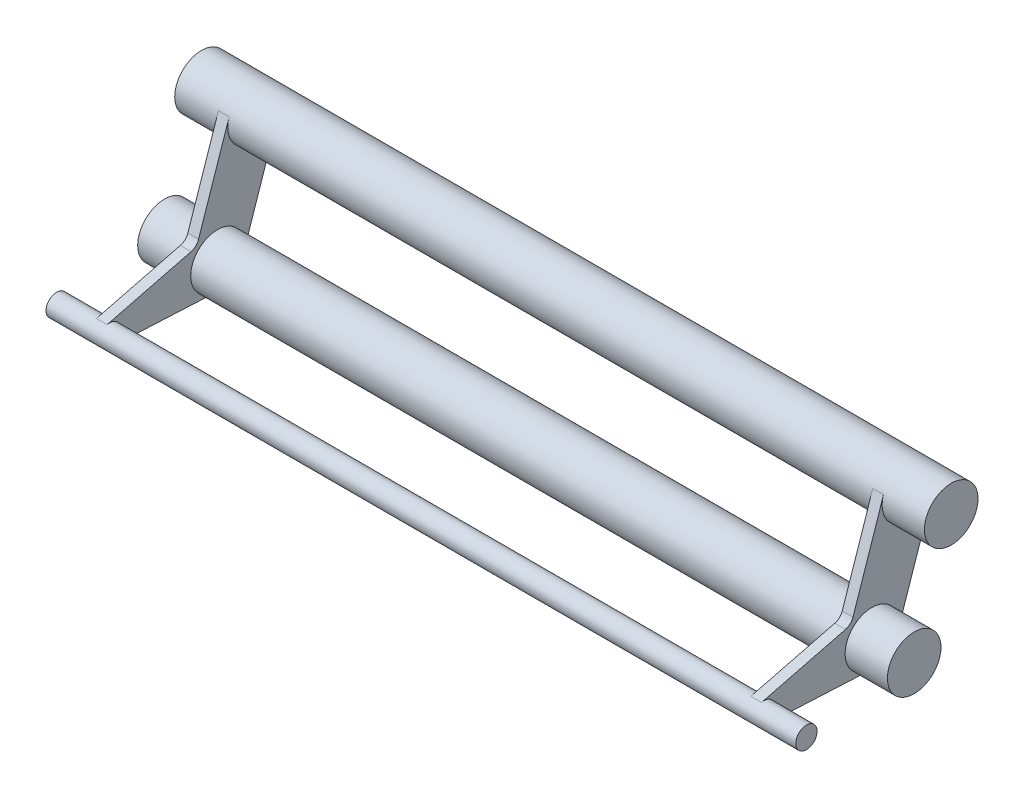
ISO-10303-21;
HEADER;
FILE_DESCRIPTION(('STEP AP214'),'2;1');
FILE_NAME('part.step','',(''),(''),'','','');
FILE_SCHEMA(('AUTOMOTIVE_DESIGN { 1 0 10303 214 1 1 1 1 }'));
ENDSEC;
DATA;
#1=APPLICATION_CONTEXT('core data for automotive mechanical design processes');
#2=APPLICATION_PROTOCOL_DEFINITION('international standard','automotive_design',2000,#1);
#3=PRODUCT_CONTEXT('',#1,'mechanical');
#4=PRODUCT('Part','Part','',(#3));
#5=PRODUCT_RELATED_PRODUCT_CATEGORY('part','',(#4));
#6=PRODUCT_DEFINITION_FORMATION('','',#4);
#7=PRODUCT_DEFINITION_CONTEXT('part definition',#1,'design');
#8=PRODUCT_DEFINITION('design','',#6,#7);
#9=PRODUCT_DEFINITION_SHAPE('','',#8);
#10=(LENGTH_UNIT() NAMED_UNIT(*) SI_UNIT(.MILLI.,.METRE.));
#11=(NAMED_UNIT(*) PLANE_ANGLE_UNIT() SI_UNIT($,.RADIAN.));
#12=(NAMED_UNIT(*) SI_UNIT($,.STERADIAN.) SOLID_ANGLE_UNIT());
#13=UNCERTAINTY_MEASURE_WITH_UNIT(LENGTH_MEASURE(1.E-05),#10,'distance_accuracy_value','');
#14=(GEOMETRIC_REPRESENTATION_CONTEXT(3) GLOBAL_UNCERTAINTY_ASSIGNED_CONTEXT((#13)) GLOBAL_UNIT_ASSIGNED_CONTEXT((#10,
#11,#12)) REPRESENTATION_CONTEXT('',''));
#15=CARTESIAN_POINT('',(0.,0.,0.));
#16=DIRECTION('',(0.,0.,1.));
#17=DIRECTION('',(1.,0.,0.));
#18=AXIS2_PLACEMENT_3D('',#15,#16,#17);
#19=CARTESIAN_POINT('',(122.2,0.,0.));
#20=DIRECTION('',(1.,0.,0.));
#21=DIRECTION('',(0.,0.,-1.));
#22=AXIS2_PLACEMENT_3D('',#19,#20,#21);
#23=PLANE('',#22);
#24=DIRECTION('',(0.,-0.245457617101326,0.96940732316552));
#25=VECTOR('',#24,1.);
#26=CARTESIAN_POINT('',(122.2,-20.6404404910664,27.5268420690193));
#27=LINE('',#26,#25);
#28=CARTESIAN_POINT('',(122.2,-16.6693565555392,11.8434915441268));
#29=VERTEX_POINT('',#28);
#30=CARTESIAN_POINT('',(122.2,-20.6404404910664,27.5268420690193));
#31=VERTEX_POINT('',#30);
#32=EDGE_CURVE('E226',#29,#31,#27,.T.);
#33=ORIENTED_EDGE('',*,*,#32,.T.);
#34=CARTESIAN_POINT('',(122.2,-22.5792551373974,27.0359268348167));
#35=DIRECTION('',(1.,0.,0.));
#36=DIRECTION('',(0.,0.,-1.));
#37=AXIS2_PLACEMENT_3D('',#34,#35,#36);
#38=CIRCLE('',#37,2.);
#39=CARTESIAN_POINT('',(122.2,-24.5767712486235,27.1355731362642));
#40=VERTEX_POINT('',#39);
#41=EDGE_CURVE('E200',#40,#31,#38,.T.);
#42=ORIENTED_EDGE('',*,*,#41,.F.);
#43=DIRECTION('',(0.,-0.0498231507237695,-0.998758055613048));
#44=VECTOR('',#43,1.);
#45=CARTESIAN_POINT('',(122.2,-25.5730454154626,7.16419767575851));
#46=LINE('',#45,#44);
#47=CARTESIAN_POINT('',(122.2,-25.5730454154626,7.16419767575851));
#48=VERTEX_POINT('',#47);
#49=EDGE_CURVE('E228',#40,#48,#46,.T.);
#50=ORIENTED_EDGE('',*,*,#49,.T.);
#51=CARTESIAN_POINT('',(122.2,-20.5792551373974,6.91508192213966));
#52=DIRECTION('',(1.,0.,0.));
#53=DIRECTION('',(0.,0.,-1.));
#54=AXIS2_PLACEMENT_3D('',#51,#52,#53);
#55=CIRCLE('',#54,5.);
#56=CARTESIAN_POINT('',(122.2,-22.1718580674157,2.17550220371557));
#57=VERTEX_POINT('',#56);
#58=EDGE_CURVE('E203',#57,#48,#55,.T.);
#59=ORIENTED_EDGE('',*,*,#58,.F.);
#60=DIRECTION('',(0.,0.947915943684818,-0.318520586003669));
#61=VECTOR('',#60,1.);
#62=CARTESIAN_POINT('',(122.2,-1.59260293001835,-4.73957971842409));
#63=LINE('',#62,#61);
#64=CARTESIAN_POINT('',(122.2,-1.59260293001835,-4.73957971842409));
#65=VERTEX_POINT('',#64);
#66=EDGE_CURVE('E231',#57,#65,#63,.T.);
#67=ORIENTED_EDGE('',*,*,#66,.T.);
#68=CARTESIAN_POINT('',(122.2,0.,0.));
#69=DIRECTION('',(1.,0.,0.));
#70=DIRECTION('',(0.,0.,-1.));
#71=AXIS2_PLACEMENT_3D('',#68,#69,#70);
#72=CIRCLE('',#71,5.);
#73=CARTESIAN_POINT('',(122.2,1.59260293001835,4.73957971842409));
#74=VERTEX_POINT('',#73);
#75=EDGE_CURVE('E207',#74,#65,#72,.T.);
#76=ORIENTED_EDGE('',*,*,#75,.F.);
#77=DIRECTION('',(0.,-0.947915943684818,0.318520586003669));
#78=VECTOR('',#77,1.);
#79=CARTESIAN_POINT('',(122.2,-15.3675830812155,10.4385748909598));
#80=LINE('',#79,#78);
#81=CARTESIAN_POINT('',(122.2,-15.3675830812155,10.4385748909598));
#82=VERTEX_POINT('',#81);
#83=EDGE_CURVE('E221',#74,#82,#80,.T.);
#84=ORIENTED_EDGE('',*,*,#83,.T.);
#85=CARTESIAN_POINT('',(122.2,-14.7305419092082,12.3344067783295));
#86=DIRECTION('',(-1.,0.,0.));
#87=DIRECTION('',(0.,0.,-1.));
#88=AXIS2_PLACEMENT_3D('',#85,#86,#87);
#89=CIRCLE('',#88,2.);
#90=EDGE_CURVE('E223',#82,#29,#89,.T.);
#91=ORIENTED_EDGE('',*,*,#90,.T.);
#92=EDGE_LOOP('',(#33,#42,#50,#59,#67,#76,#84,#91));
#93=FACE_BOUND('',#92,.T.);
#94=ADVANCED_FACE('F47',(#93),#23,.T.);
#95=CARTESIAN_POINT('',(120.2,0.,0.));
#96=DIRECTION('',(-1.,0.,0.));
#97=DIRECTION('',(0.,0.,1.));
#98=AXIS2_PLACEMENT_3D('',#95,#96,#97);
#99=CYLINDRICAL_SURFACE('',#98,5.);
#100=CARTESIAN_POINT('',(120.2,0.,0.));
#101=DIRECTION('',(1.,0.,0.));
#102=DIRECTION('',(0.,0.,-1.));
#103=AXIS2_PLACEMENT_3D('',#100,#101,#102);
#104=CIRCLE('',#103,5.);
#105=CARTESIAN_POINT('',(120.2,1.59260293001835,4.73957971842409));
#106=VERTEX_POINT('',#105);
#107=CARTESIAN_POINT('',(120.2,-1.59260293001835,-4.73957971842409));
#108=VERTEX_POINT('',#107);
#109=EDGE_CURVE('E62',#106,#108,#104,.T.);
#110=ORIENTED_EDGE('',*,*,#109,.F.);
#111=DIRECTION('',(-1.,0.,0.));
#112=VECTOR('',#111,1.);
#113=CARTESIAN_POINT('',(122.2,1.59260293001835,4.73957971842409));
#114=LINE('',#113,#112);
#115=EDGE_CURVE('E262',#74,#106,#114,.T.);
#116=ORIENTED_EDGE('',*,*,#115,.F.);
#117=ORIENTED_EDGE('',*,*,#75,.T.);
#118=DIRECTION('',(-1.,0.,0.));
#119=VECTOR('',#118,1.);
#120=CARTESIAN_POINT('',(122.2,-1.59260293001835,-4.73957971842409));
#121=LINE('',#120,#119);
#122=EDGE_CURVE('E233',#65,#108,#121,.T.);
#123=ORIENTED_EDGE('',*,*,#122,.T.);
#124=EDGE_LOOP('',(#110,#116,#117,#123));
#125=FACE_BOUND('',#124,.T.);
#126=CARTESIAN_POINT('',(0.,0.,0.));
#127=DIRECTION('',(1.,0.,0.));
#128=DIRECTION('',(0.,0.,-1.));
#129=AXIS2_PLACEMENT_3D('',#126,#127,#128);
#130=CIRCLE('',#129,5.);
#131=CARTESIAN_POINT('',(0.,1.59260293001835,4.73957971842409));
#132=VERTEX_POINT('',#131);
#133=CARTESIAN_POINT('',(0.,-1.59260293001835,-4.73957971842409));
#134=VERTEX_POINT('',#133);
#135=EDGE_CURVE('E307',#132,#134,#130,.T.);
#136=ORIENTED_EDGE('',*,*,#135,.T.);
#137=DIRECTION('',(1.,0.,0.));
#138=VECTOR('',#137,1.);
#139=CARTESIAN_POINT('',(-2.,-1.59260293001835,-4.73957971842409));
#140=LINE('',#139,#138);
#141=CARTESIAN_POINT('',(-2.,-1.59260293001835,-4.73957971842409));
#142=VERTEX_POINT('',#141);
#143=EDGE_CURVE('E300',#142,#134,#140,.T.);
#144=ORIENTED_EDGE('',*,*,#143,.F.);
#145=CARTESIAN_POINT('',(-2.,0.,0.));
#146=DIRECTION('',(-1.,0.,0.));
#147=DIRECTION('',(0.,0.,1.));
#148=AXIS2_PLACEMENT_3D('',#145,#146,#147);
#149=CIRCLE('',#148,5.);
#150=CARTESIAN_POINT('',(-2.,1.59260293001835,4.73957971842409));
#151=VERTEX_POINT('',#150);
#152=EDGE_CURVE('E55',#142,#151,#149,.T.);
#153=ORIENTED_EDGE('',*,*,#152,.T.);
#154=DIRECTION('',(1.,0.,0.));
#155=VECTOR('',#154,1.);
#156=CARTESIAN_POINT('',(-2.,1.59260293001835,4.73957971842409));
#157=LINE('',#156,#155);
#158=EDGE_CURVE('E302',#151,#132,#157,.T.);
#159=ORIENTED_EDGE('',*,*,#158,.T.);
#160=EDGE_LOOP('',(#136,#144,#153,#159));
#161=FACE_BOUND('',#160,.T.);
#162=CARTESIAN_POINT('',(130.1,0.,0.));
#163=DIRECTION('',(1.,0.,0.));
#164=DIRECTION('',(0.,0.,-1.));
#165=AXIS2_PLACEMENT_3D('',#162,#163,#164);
#166=CIRCLE('',#165,5.);
#167=CARTESIAN_POINT('',(130.1,0.,-5.));
#168=VERTEX_POINT('',#167);
#169=EDGE_CURVE('E210',#168,#168,#166,.T.);
#170=ORIENTED_EDGE('',*,*,#169,.F.);
#171=EDGE_LOOP('',(#170));
#172=FACE_BOUND('',#171,.T.);
#173=CARTESIAN_POINT('',(-9.9,0.,0.));
#174=DIRECTION('',(-1.,0.,0.));
#175=DIRECTION('',(0.,0.,1.));
#176=AXIS2_PLACEMENT_3D('',#173,#174,#175);
#177=CIRCLE('',#176,5.);
#178=CARTESIAN_POINT('',(-9.9,0.,5.));
#179=VERTEX_POINT('',#178);
#180=EDGE_CURVE('E197',#179,#179,#177,.T.);
#181=ORIENTED_EDGE('',*,*,#180,.F.);
#182=EDGE_LOOP('',(#181));
#183=FACE_BOUND('',#182,.T.);
#184=ADVANCED_FACE('F49',(#125,#161,#172,#183),#99,.T.);
#185=CARTESIAN_POINT('',(0.,-14.7305419092082,12.3344067783295));
#186=DIRECTION('',(1.,0.,0.));
#187=DIRECTION('',(0.,0.,-1.));
#188=AXIS2_PLACEMENT_3D('',#185,#186,#187);
#189=PLANE('',#188);
#190=DIRECTION('',(0.,0.245457617101326,-0.96940732316552));
#191=VECTOR('',#190,1.);
#192=CARTESIAN_POINT('',(0.,-16.6693565555392,11.8434915441268));
#193=LINE('',#192,#191);
#194=CARTESIAN_POINT('',(0.,-20.6404404910664,27.5268420690193));
#195=VERTEX_POINT('',#194);
#196=CARTESIAN_POINT('',(0.,-16.6693565555392,11.8434915441268));
#197=VERTEX_POINT('',#196);
#198=EDGE_CURVE('E277',#195,#197,#193,.T.);
#199=ORIENTED_EDGE('',*,*,#198,.F.);
#200=CARTESIAN_POINT('',(0.,-22.5792551373974,27.0359268348167));
#201=DIRECTION('',(1.,0.,0.));
#202=DIRECTION('',(0.,0.,-1.));
#203=AXIS2_PLACEMENT_3D('',#200,#201,#202);
#204=CIRCLE('',#203,2.);
#205=CARTESIAN_POINT('',(0.,-24.5767712486235,27.1355731362642));
#206=VERTEX_POINT('',#205);
#207=EDGE_CURVE('E268',#206,#195,#204,.T.);
#208=ORIENTED_EDGE('',*,*,#207,.F.);
#209=DIRECTION('',(0.,0.0498231507237695,0.998758055613048));
#210=VECTOR('',#209,1.);
#211=CARTESIAN_POINT('',(0.,-25.5730454154626,7.16419767575851));
#212=LINE('',#211,#210);
#213=CARTESIAN_POINT('',(0.,-25.5730454154626,7.16419767575851));
#214=VERTEX_POINT('',#213);
#215=EDGE_CURVE('E169',#214,#206,#212,.T.);
#216=ORIENTED_EDGE('',*,*,#215,.F.);
#217=CARTESIAN_POINT('',(0.,-20.5792551373974,6.91508192213966));
#218=DIRECTION('',(1.,0.,0.));
#219=DIRECTION('',(0.,0.,-1.));
#220=AXIS2_PLACEMENT_3D('',#217,#218,#219);
#221=CIRCLE('',#220,5.);
#222=CARTESIAN_POINT('',(0.,-22.1718580674157,2.17550220371557));
#223=VERTEX_POINT('',#222);
#224=EDGE_CURVE('E267',#223,#214,#221,.T.);
#225=ORIENTED_EDGE('',*,*,#224,.F.);
#226=DIRECTION('',(0.,-0.947915943684818,0.318520586003669));
#227=VECTOR('',#226,1.);
#228=CARTESIAN_POINT('',(0.,-1.59260293001835,-4.73957971842409));
#229=LINE('',#228,#227);
#230=EDGE_CURVE('E288',#134,#223,#229,.T.);
#231=ORIENTED_EDGE('',*,*,#230,.F.);
#232=ORIENTED_EDGE('',*,*,#135,.F.);
#233=DIRECTION('',(0.,0.947915943684818,-0.318520586003669));
#234=VECTOR('',#233,1.);
#235=CARTESIAN_POINT('',(0.,1.59260293001835,4.73957971842409));
#236=LINE('',#235,#234);
#237=CARTESIAN_POINT('',(0.,-15.3675830812155,10.4385748909598));
#238=VERTEX_POINT('',#237);
#239=EDGE_CURVE('E285',#238,#132,#236,.T.);
#240=ORIENTED_EDGE('',*,*,#239,.F.);
#241=CARTESIAN_POINT('',(0.,-14.7305419092082,12.3344067783295));
#242=DIRECTION('',(1.,0.,0.));
#243=DIRECTION('',(0.,0.,-1.));
#244=AXIS2_PLACEMENT_3D('',#241,#242,#243);
#245=CIRCLE('',#244,2.);
#246=EDGE_CURVE('E272',#197,#238,#245,.T.);
#247=ORIENTED_EDGE('',*,*,#246,.F.);
#248=EDGE_LOOP('',(#199,#208,#216,#225,#231,#232,#240,#247));
#249=FACE_BOUND('',#248,.T.);
#250=ADVANCED_FACE('F317',(#249),#189,.T.);
#251=CARTESIAN_POINT('',(-2.,-14.7305419092082,12.3344067783295));
#252=DIRECTION('',(1.,0.,0.));
#253=DIRECTION('',(0.,0.,-1.));
#254=AXIS2_PLACEMENT_3D('',#251,#252,#253);
#255=CYLINDRICAL_SURFACE('',#254,2.);
#256=ORIENTED_EDGE('',*,*,#246,.T.);
#257=DIRECTION('',(1.,0.,0.));
#258=VECTOR('',#257,1.);
#259=CARTESIAN_POINT('',(-2.,-15.3675830812155,10.4385748909598));
#260=LINE('',#259,#258);
#261=CARTESIAN_POINT('',(-2.,-15.3675830812155,10.4385748909598));
#262=VERTEX_POINT('',#261);
#263=EDGE_CURVE('E304',#262,#238,#260,.T.);
#264=ORIENTED_EDGE('',*,*,#263,.F.);
#265=CARTESIAN_POINT('',(-2.,-14.7305419092082,12.3344067783295));
#266=DIRECTION('',(1.,0.,0.));
#267=DIRECTION('',(0.,0.,-1.));
#268=AXIS2_PLACEMENT_3D('',#265,#266,#267);
#269=CIRCLE('',#268,2.);
#270=CARTESIAN_POINT('',(-2.,-16.6693565555392,11.8434915441268));
#271=VERTEX_POINT('',#270);
#272=EDGE_CURVE('E273',#271,#262,#269,.T.);
#273=ORIENTED_EDGE('',*,*,#272,.F.);
#274=DIRECTION('',(1.,0.,0.));
#275=VECTOR('',#274,1.);
#276=CARTESIAN_POINT('',(-2.,-16.6693565555392,11.8434915441268));
#277=LINE('',#276,#275);
#278=EDGE_CURVE('E282',#271,#197,#277,.T.);
#279=ORIENTED_EDGE('',*,*,#278,.T.);
#280=EDGE_LOOP('',(#256,#264,#273,#279));
#281=FACE_BOUND('',#280,.T.);
#282=ADVANCED_FACE('F329',(#281),#255,.F.);
#283=CARTESIAN_POINT('',(-2.,1.59260293001835,4.73957971842409));
#284=DIRECTION('',(0.,-0.318520586003669,-0.947915943684818));
#285=DIRECTION('',(0.,0.947915943684818,-0.318520586003669));
#286=AXIS2_PLACEMENT_3D('',#283,#284,#285);
#287=PLANE('',#286);
#288=ORIENTED_EDGE('',*,*,#239,.T.);
#289=ORIENTED_EDGE('',*,*,#158,.F.);
#290=DIRECTION('',(0.,0.947915943684818,-0.318520586003669));
#291=VECTOR('',#290,1.);
#292=CARTESIAN_POINT('',(-2.,1.59260293001835,4.73957971842409));
#293=LINE('',#292,#291);
#294=EDGE_CURVE('E276',#262,#151,#293,.T.);
#295=ORIENTED_EDGE('',*,*,#294,.F.);
#296=ORIENTED_EDGE('',*,*,#263,.T.);
#297=EDGE_LOOP('',(#288,#289,#295,#296));
#298=FACE_BOUND('',#297,.T.);
#299=ADVANCED_FACE('F331',(#298),#287,.F.);
#300=CARTESIAN_POINT('',(-2.,-1.59260293001835,-4.73957971842409));
#301=DIRECTION('',(0.,0.318520586003669,0.947915943684818));
#302=DIRECTION('',(0.,-0.947915943684818,0.318520586003669));
#303=AXIS2_PLACEMENT_3D('',#300,#301,#302);
#304=PLANE('',#303);
#305=ORIENTED_EDGE('',*,*,#230,.T.);
#306=DIRECTION('',(1.,0.,0.));
#307=VECTOR('',#306,1.);
#308=CARTESIAN_POINT('',(-2.,-22.1718580674157,2.17550220371557));
#309=LINE('',#308,#307);
#310=CARTESIAN_POINT('',(-2.,-22.1718580674157,2.17550220371557));
#311=VERTEX_POINT('',#310);
#312=EDGE_CURVE('E297',#311,#223,#309,.T.);
#313=ORIENTED_EDGE('',*,*,#312,.F.);
#314=DIRECTION('',(0.,-0.947915943684818,0.318520586003669));
#315=VECTOR('',#314,1.);
#316=CARTESIAN_POINT('',(-2.,-1.59260293001835,-4.73957971842409));
#317=LINE('',#316,#315);
#318=EDGE_CURVE('E182',#142,#311,#317,.T.);
#319=ORIENTED_EDGE('',*,*,#318,.F.);
#320=ORIENTED_EDGE('',*,*,#143,.T.);
#321=EDGE_LOOP('',(#305,#313,#319,#320));
#322=FACE_BOUND('',#321,.T.);
#323=ADVANCED_FACE('F320',(#322),#304,.F.);
#324=CARTESIAN_POINT('',(-2.,-20.5792551373974,6.91508192213966));
#325=DIRECTION('',(1.,0.,0.));
#326=DIRECTION('',(0.,0.,-1.));
#327=AXIS2_PLACEMENT_3D('',#324,#325,#326);
#328=CYLINDRICAL_SURFACE('',#327,5.);
#329=ORIENTED_EDGE('',*,*,#312,.T.);
#330=ORIENTED_EDGE('',*,*,#224,.T.);
#331=DIRECTION('',(1.,0.,0.));
#332=VECTOR('',#331,1.);
#333=CARTESIAN_POINT('',(-2.,-25.5730454154626,7.16419767575851));
#334=LINE('',#333,#332);
#335=CARTESIAN_POINT('',(-2.,-25.5730454154626,7.16419767575851));
#336=VERTEX_POINT('',#335);
#337=EDGE_CURVE('E172',#336,#214,#334,.T.);
#338=ORIENTED_EDGE('',*,*,#337,.F.);
#339=CARTESIAN_POINT('',(-2.,-20.5792551373974,6.91508192213966));
#340=DIRECTION('',(1.,0.,0.));
#341=DIRECTION('',(0.,0.,-1.));
#342=AXIS2_PLACEMENT_3D('',#339,#340,#341);
#343=CIRCLE('',#342,5.);
#344=EDGE_CURVE('E12',#336,#311,#343,.F.);
#345=ORIENTED_EDGE('',*,*,#344,.T.);
#346=EDGE_LOOP('',(#329,#330,#338,#345));
#347=FACE_BOUND('',#346,.T.);
#348=CARTESIAN_POINT('',(120.2,-20.5792551373974,6.91508192213966));
#349=DIRECTION('',(1.,0.,0.));
#350=DIRECTION('',(0.,0.,-1.));
#351=AXIS2_PLACEMENT_3D('',#348,#349,#350);
#352=CIRCLE('',#351,5.);
#353=CARTESIAN_POINT('',(120.2,-22.1718580674157,2.17550220371557));
#354=VERTEX_POINT('',#353);
#355=CARTESIAN_POINT('',(120.2,-25.5730454154626,7.16419767575851));
#356=VERTEX_POINT('',#355);
#357=EDGE_CURVE('E70',#354,#356,#352,.T.);
#358=ORIENTED_EDGE('',*,*,#357,.F.);
#359=DIRECTION('',(-1.,0.,0.));
#360=VECTOR('',#359,1.);
#361=CARTESIAN_POINT('',(122.2,-22.1718580674157,2.17550220371557));
#362=LINE('',#361,#360);
#363=EDGE_CURVE('E246',#57,#354,#362,.T.);
#364=ORIENTED_EDGE('',*,*,#363,.F.);
#365=ORIENTED_EDGE('',*,*,#58,.T.);
#366=DIRECTION('',(-1.,0.,0.));
#367=VECTOR('',#366,1.);
#368=CARTESIAN_POINT('',(122.2,-25.5730454154626,7.16419767575851));
#369=LINE('',#368,#367);
#370=EDGE_CURVE('E248',#48,#356,#369,.T.);
#371=ORIENTED_EDGE('',*,*,#370,.T.);
#372=EDGE_LOOP('',(#358,#364,#365,#371));
#373=FACE_BOUND('',#372,.T.);
#374=CARTESIAN_POINT('',(130.1,-20.5792551373974,6.91508192213966));
#375=DIRECTION('',(1.,0.,0.));
#376=DIRECTION('',(0.,0.,-1.));
#377=AXIS2_PLACEMENT_3D('',#374,#375,#376);
#378=CIRCLE('',#377,5.);
#379=CARTESIAN_POINT('',(130.1,-20.5792551373974,1.91508192213966));
#380=VERTEX_POINT('',#379);
#381=EDGE_CURVE('E213',#380,#380,#378,.T.);
#382=ORIENTED_EDGE('',*,*,#381,.F.);
#383=EDGE_LOOP('',(#382));
#384=FACE_BOUND('',#383,.T.);
#385=CARTESIAN_POINT('',(-9.9,-20.5792551373974,6.91508192213966));
#386=DIRECTION('',(-1.,0.,0.));
#387=DIRECTION('',(0.,0.,1.));
#388=AXIS2_PLACEMENT_3D('',#385,#386,#387);
#389=CIRCLE('',#388,5.);
#390=CARTESIAN_POINT('',(-9.9,-20.5792551373974,11.9150819221397));
#391=VERTEX_POINT('',#390);
#392=EDGE_CURVE('E192',#391,#391,#389,.T.);
#393=ORIENTED_EDGE('',*,*,#392,.F.);
#394=EDGE_LOOP('',(#393));
#395=FACE_BOUND('',#394,.T.);
#396=ADVANCED_FACE('F322',(#347,#373,#384,#395),#328,.T.);
#397=CARTESIAN_POINT('',(-2.,-25.5730454154626,7.16419767575851));
#398=DIRECTION('',(0.,0.998758055613048,-0.0498231507237695));
#399=DIRECTION('',(0.,0.0498231507237695,0.998758055613048));
#400=AXIS2_PLACEMENT_3D('',#397,#398,#399);
#401=PLANE('',#400);
#402=ORIENTED_EDGE('',*,*,#215,.T.);
#403=DIRECTION('',(1.,0.,0.));
#404=VECTOR('',#403,1.);
#405=CARTESIAN_POINT('',(-2.,-24.5767712486235,27.1355731362642));
#406=LINE('',#405,#404);
#407=CARTESIAN_POINT('',(-2.,-24.5767712486235,27.1355731362642));
#408=VERTEX_POINT('',#407);
#409=EDGE_CURVE('E163',#408,#206,#406,.T.);
#410=ORIENTED_EDGE('',*,*,#409,.F.);
#411=DIRECTION('',(0.,0.0498231507237695,0.998758055613048));
#412=VECTOR('',#411,1.);
#413=CARTESIAN_POINT('',(-2.,-25.5730454154626,7.16419767575851));
#414=LINE('',#413,#412);
#415=EDGE_CURVE('E167',#336,#408,#414,.T.);
#416=ORIENTED_EDGE('',*,*,#415,.F.);
#417=ORIENTED_EDGE('',*,*,#337,.T.);
#418=EDGE_LOOP('',(#402,#410,#416,#417));
#419=FACE_BOUND('',#418,.T.);
#420=ADVANCED_FACE('F165',(#419),#401,.F.);
#421=CARTESIAN_POINT('',(-2.,-22.5792551373974,27.0359268348167));
#422=DIRECTION('',(1.,0.,0.));
#423=DIRECTION('',(0.,0.,-1.));
#424=AXIS2_PLACEMENT_3D('',#421,#422,#423);
#425=CYLINDRICAL_SURFACE('',#424,2.);
#426=ORIENTED_EDGE('',*,*,#409,.T.);
#427=ORIENTED_EDGE('',*,*,#207,.T.);
#428=DIRECTION('',(1.,0.,0.));
#429=VECTOR('',#428,1.);
#430=CARTESIAN_POINT('',(-2.,-20.6404404910664,27.5268420690193));
#431=LINE('',#430,#429);
#432=CARTESIAN_POINT('',(-2.,-20.6404404910664,27.5268420690193));
#433=VERTEX_POINT('',#432);
#434=EDGE_CURVE('E173',#433,#195,#431,.T.);
#435=ORIENTED_EDGE('',*,*,#434,.F.);
#436=CARTESIAN_POINT('',(-2.,-22.5792551373974,27.0359268348167));
#437=DIRECTION('',(-1.,0.,0.));
#438=DIRECTION('',(0.,0.,1.));
#439=AXIS2_PLACEMENT_3D('',#436,#437,#438);
#440=CIRCLE('',#439,2.);
#441=EDGE_CURVE('E177',#433,#408,#440,.T.);
#442=ORIENTED_EDGE('',*,*,#441,.T.);
#443=EDGE_LOOP('',(#426,#427,#435,#442));
#444=FACE_BOUND('',#443,.T.);
#445=CARTESIAN_POINT('',(120.2,-22.5792551373974,27.0359268348167));
#446=DIRECTION('',(1.,0.,0.));
#447=DIRECTION('',(0.,0.,-1.));
#448=AXIS2_PLACEMENT_3D('',#445,#446,#447);
#449=CIRCLE('',#448,2.);
#450=CARTESIAN_POINT('',(120.2,-24.5767712486235,27.1355731362642));
#451=VERTEX_POINT('',#450);
#452=CARTESIAN_POINT('',(120.2,-20.6404404910664,27.5268420690193));
#453=VERTEX_POINT('',#452);
#454=EDGE_CURVE('E265',#451,#453,#449,.T.);
#455=ORIENTED_EDGE('',*,*,#454,.F.);
#456=DIRECTION('',(-1.,0.,0.));
#457=VECTOR('',#456,1.);
#458=CARTESIAN_POINT('',(122.2,-24.5767712486235,27.1355731362642));
#459=LINE('',#458,#457);
#460=EDGE_CURVE('E250',#40,#451,#459,.T.);
#461=ORIENTED_EDGE('',*,*,#460,.F.);
#462=ORIENTED_EDGE('',*,*,#41,.T.);
#463=DIRECTION('',(-1.,0.,0.));
#464=VECTOR('',#463,1.);
#465=CARTESIAN_POINT('',(122.2,-20.6404404910664,27.5268420690193));
#466=LINE('',#465,#464);
#467=EDGE_CURVE('E253',#31,#453,#466,.T.);
#468=ORIENTED_EDGE('',*,*,#467,.T.);
#469=EDGE_LOOP('',(#455,#461,#462,#468));
#470=FACE_BOUND('',#469,.T.);
#471=CARTESIAN_POINT('',(130.1,-22.5792551373974,27.0359268348167));
#472=DIRECTION('',(1.,0.,0.));
#473=DIRECTION('',(0.,0.,-1.));
#474=AXIS2_PLACEMENT_3D('',#471,#472,#473);
#475=CIRCLE('',#474,2.);
#476=CARTESIAN_POINT('',(130.1,-22.5792551373974,25.0359268348167));
#477=VERTEX_POINT('',#476);
#478=EDGE_CURVE('E204',#477,#477,#475,.T.);
#479=ORIENTED_EDGE('',*,*,#478,.F.);
#480=EDGE_LOOP('',(#479));
#481=FACE_BOUND('',#480,.T.);
#482=CARTESIAN_POINT('',(-9.9,-22.5792551373974,27.0359268348167));
#483=DIRECTION('',(-1.,0.,0.));
#484=DIRECTION('',(0.,0.,1.));
#485=AXIS2_PLACEMENT_3D('',#482,#483,#484);
#486=CIRCLE('',#485,2.);
#487=CARTESIAN_POINT('',(-9.9,-22.5792551373974,29.0359268348167));
#488=VERTEX_POINT('',#487);
#489=EDGE_CURVE('E188',#488,#488,#486,.T.);
#490=ORIENTED_EDGE('',*,*,#489,.F.);
#491=EDGE_LOOP('',(#490));
#492=FACE_BOUND('',#491,.T.);
#493=ADVANCED_FACE('F184',(#444,#470,#481,#492),#425,.T.);
#494=CARTESIAN_POINT('',(-2.,-16.6693565555392,11.8434915441268));
#495=DIRECTION('',(0.,-0.96940732316552,-0.245457617101326));
#496=DIRECTION('',(0.,0.245457617101326,-0.96940732316552));
#497=AXIS2_PLACEMENT_3D('',#494,#495,#496);
#498=PLANE('',#497);
#499=ORIENTED_EDGE('',*,*,#198,.T.);
#500=ORIENTED_EDGE('',*,*,#278,.F.);
#501=DIRECTION('',(0.,0.245457617101326,-0.96940732316552));
#502=VECTOR('',#501,1.);
#503=CARTESIAN_POINT('',(-2.,-16.6693565555392,11.8434915441268));
#504=LINE('',#503,#502);
#505=EDGE_CURVE('E181',#433,#271,#504,.T.);
#506=ORIENTED_EDGE('',*,*,#505,.F.);
#507=ORIENTED_EDGE('',*,*,#434,.T.);
#508=EDGE_LOOP('',(#499,#500,#506,#507));
#509=FACE_BOUND('',#508,.T.);
#510=ADVANCED_FACE('F324',(#509),#498,.F.);
#511=CARTESIAN_POINT('',(-2.,-14.7305419092082,12.3344067783295));
#512=DIRECTION('',(1.,0.,0.));
#513=DIRECTION('',(0.,0.,-1.));
#514=AXIS2_PLACEMENT_3D('',#511,#512,#513);
#515=PLANE('',#514);
#516=ORIENTED_EDGE('',*,*,#441,.F.);
#517=ORIENTED_EDGE('',*,*,#505,.T.);
#518=ORIENTED_EDGE('',*,*,#272,.T.);
#519=ORIENTED_EDGE('',*,*,#294,.T.);
#520=ORIENTED_EDGE('',*,*,#152,.F.);
#521=ORIENTED_EDGE('',*,*,#318,.T.);
#522=ORIENTED_EDGE('',*,*,#344,.F.);
#523=ORIENTED_EDGE('',*,*,#415,.T.);
#524=EDGE_LOOP('',(#516,#517,#518,#519,#520,#521,#522,#523));
#525=FACE_BOUND('',#524,.T.);
#526=ADVANCED_FACE('F176',(#525),#515,.F.);
#527=CARTESIAN_POINT('',(120.2,0.,0.));
#528=DIRECTION('',(1.,0.,0.));
#529=DIRECTION('',(0.,0.,-1.));
#530=AXIS2_PLACEMENT_3D('',#527,#528,#529);
#531=PLANE('',#530);
#532=DIRECTION('',(0.,-0.947915943684818,0.318520586003669));
#533=VECTOR('',#532,1.);
#534=CARTESIAN_POINT('',(120.2,-15.3675830812155,10.4385748909598));
#535=LINE('',#534,#533);
#536=CARTESIAN_POINT('',(120.2,-15.3675830812155,10.4385748909598));
#537=VERTEX_POINT('',#536);
#538=EDGE_CURVE('E218',#106,#537,#535,.T.);
#539=ORIENTED_EDGE('',*,*,#538,.F.);
#540=ORIENTED_EDGE('',*,*,#109,.T.);
#541=DIRECTION('',(0.,0.947915943684818,-0.318520586003669));
#542=VECTOR('',#541,1.);
#543=CARTESIAN_POINT('',(120.2,-1.59260293001835,-4.73957971842409));
#544=LINE('',#543,#542);
#545=EDGE_CURVE('E224',#354,#108,#544,.T.);
#546=ORIENTED_EDGE('',*,*,#545,.F.);
#547=ORIENTED_EDGE('',*,*,#357,.T.);
#548=DIRECTION('',(0.,-0.0498231507237695,-0.998758055613048));
#549=VECTOR('',#548,1.);
#550=CARTESIAN_POINT('',(120.2,-25.5730454154626,7.16419767575851));
#551=LINE('',#550,#549);
#552=EDGE_CURVE('E240',#451,#356,#551,.T.);
#553=ORIENTED_EDGE('',*,*,#552,.F.);
#554=ORIENTED_EDGE('',*,*,#454,.T.);
#555=DIRECTION('',(0.,-0.245457617101326,0.96940732316552));
#556=VECTOR('',#555,1.);
#557=CARTESIAN_POINT('',(120.2,-20.6404404910664,27.5268420690193));
#558=LINE('',#557,#556);
#559=CARTESIAN_POINT('',(120.2,-16.6693565555392,11.8434915441268));
#560=VERTEX_POINT('',#559);
#561=EDGE_CURVE('E237',#560,#453,#558,.T.);
#562=ORIENTED_EDGE('',*,*,#561,.F.);
#563=CARTESIAN_POINT('',(120.2,-14.7305419092082,12.3344067783295));
#564=DIRECTION('',(-1.,0.,0.));
#565=DIRECTION('',(0.,0.,-1.));
#566=AXIS2_PLACEMENT_3D('',#563,#564,#565);
#567=CIRCLE('',#566,2.);
#568=EDGE_CURVE('E235',#537,#560,#567,.T.);
#569=ORIENTED_EDGE('',*,*,#568,.F.);
#570=EDGE_LOOP('',(#539,#540,#546,#547,#553,#554,#562,#569));
#571=FACE_BOUND('',#570,.T.);
#572=ADVANCED_FACE('F350',(#571),#531,.F.);
#573=CARTESIAN_POINT('',(122.2,-15.3675830812155,10.4385748909598));
#574=DIRECTION('',(0.,-0.318520586003669,-0.947915943684818));
#575=DIRECTION('',(0.,0.947915943684818,-0.318520586003669));
#576=AXIS2_PLACEMENT_3D('',#573,#574,#575);
#577=PLANE('',#576);
#578=ORIENTED_EDGE('',*,*,#538,.T.);
#579=DIRECTION('',(-1.,0.,0.));
#580=VECTOR('',#579,1.);
#581=CARTESIAN_POINT('',(122.2,-15.3675830812155,10.4385748909598));
#582=LINE('',#581,#580);
#583=EDGE_CURVE('E259',#82,#537,#582,.T.);
#584=ORIENTED_EDGE('',*,*,#583,.F.);
#585=ORIENTED_EDGE('',*,*,#83,.F.);
#586=ORIENTED_EDGE('',*,*,#115,.T.);
#587=EDGE_LOOP('',(#578,#584,#585,#586));
#588=FACE_BOUND('',#587,.T.);
#589=ADVANCED_FACE('F353',(#588),#577,.F.);
#590=CARTESIAN_POINT('',(122.2,-14.7305419092082,12.3344067783295));
#591=DIRECTION('',(-1.,0.,0.));
#592=DIRECTION('',(0.,0.,1.));
#593=AXIS2_PLACEMENT_3D('',#590,#591,#592);
#594=CYLINDRICAL_SURFACE('',#593,2.);
#595=ORIENTED_EDGE('',*,*,#568,.T.);
#596=DIRECTION('',(-1.,0.,0.));
#597=VECTOR('',#596,1.);
#598=CARTESIAN_POINT('',(122.2,-16.6693565555392,11.8434915441268));
#599=LINE('',#598,#597);
#600=EDGE_CURVE('E256',#29,#560,#599,.T.);
#601=ORIENTED_EDGE('',*,*,#600,.F.);
#602=ORIENTED_EDGE('',*,*,#90,.F.);
#603=ORIENTED_EDGE('',*,*,#583,.T.);
#604=EDGE_LOOP('',(#595,#601,#602,#603));
#605=FACE_BOUND('',#604,.T.);
#606=ADVANCED_FACE('F365',(#605),#594,.F.);
#607=CARTESIAN_POINT('',(122.2,-20.6404404910664,27.5268420690193));
#608=DIRECTION('',(0.,-0.96940732316552,-0.245457617101326));
#609=DIRECTION('',(0.,0.245457617101326,-0.96940732316552));
#610=AXIS2_PLACEMENT_3D('',#607,#608,#609);
#611=PLANE('',#610);
#612=ORIENTED_EDGE('',*,*,#561,.T.);
#613=ORIENTED_EDGE('',*,*,#467,.F.);
#614=ORIENTED_EDGE('',*,*,#32,.F.);
#615=ORIENTED_EDGE('',*,*,#600,.T.);
#616=EDGE_LOOP('',(#612,#613,#614,#615));
#617=FACE_BOUND('',#616,.T.);
#618=ADVANCED_FACE('F361',(#617),#611,.F.);
#619=CARTESIAN_POINT('',(122.2,-25.5730454154626,7.16419767575851));
#620=DIRECTION('',(0.,0.998758055613048,-0.0498231507237695));
#621=DIRECTION('',(0.,0.0498231507237695,0.998758055613048));
#622=AXIS2_PLACEMENT_3D('',#619,#620,#621);
#623=PLANE('',#622);
#624=ORIENTED_EDGE('',*,*,#552,.T.);
#625=ORIENTED_EDGE('',*,*,#370,.F.);
#626=ORIENTED_EDGE('',*,*,#49,.F.);
#627=ORIENTED_EDGE('',*,*,#460,.T.);
#628=EDGE_LOOP('',(#624,#625,#626,#627));
#629=FACE_BOUND('',#628,.T.);
#630=ADVANCED_FACE('F357',(#629),#623,.F.);
#631=CARTESIAN_POINT('',(122.2,-1.59260293001835,-4.73957971842409));
#632=DIRECTION('',(0.,0.318520586003669,0.947915943684818));
#633=DIRECTION('',(0.,-0.947915943684818,0.318520586003669));
#634=AXIS2_PLACEMENT_3D('',#631,#632,#633);
#635=PLANE('',#634);
#636=ORIENTED_EDGE('',*,*,#545,.T.);
#637=ORIENTED_EDGE('',*,*,#122,.F.);
#638=ORIENTED_EDGE('',*,*,#66,.F.);
#639=ORIENTED_EDGE('',*,*,#363,.T.);
#640=EDGE_LOOP('',(#636,#637,#638,#639));
#641=FACE_BOUND('',#640,.T.);
#642=ADVANCED_FACE('F354',(#641),#635,.F.);
#643=CARTESIAN_POINT('',(130.1,0.,0.));
#644=DIRECTION('',(1.,0.,0.));
#645=DIRECTION('',(0.,0.,-1.));
#646=AXIS2_PLACEMENT_3D('',#643,#644,#645);
#647=PLANE('',#646);
#648=ORIENTED_EDGE('',*,*,#381,.T.);
#649=EDGE_LOOP('',(#648));
#650=FACE_BOUND('',#649,.T.);
#651=ADVANCED_FACE('F348',(#650),#647,.T.);
#652=CARTESIAN_POINT('',(130.1,0.,0.));
#653=DIRECTION('',(1.,0.,0.));
#654=DIRECTION('',(0.,0.,-1.));
#655=AXIS2_PLACEMENT_3D('',#652,#653,#654);
#656=PLANE('',#655);
#657=ORIENTED_EDGE('',*,*,#169,.T.);
#658=EDGE_LOOP('',(#657));
#659=FACE_BOUND('',#658,.T.);
#660=ADVANCED_FACE('F436',(#659),#656,.T.);
#661=CARTESIAN_POINT('',(130.1,0.,0.));
#662=DIRECTION('',(1.,0.,0.));
#663=DIRECTION('',(0.,0.,-1.));
#664=AXIS2_PLACEMENT_3D('',#661,#662,#663);
#665=PLANE('',#664);
#666=ORIENTED_EDGE('',*,*,#478,.T.);
#667=EDGE_LOOP('',(#666));
#668=FACE_BOUND('',#667,.T.);
#669=ADVANCED_FACE('F442',(#668),#665,.T.);
#670=CARTESIAN_POINT('',(-9.9,0.,0.));
#671=DIRECTION('',(-1.,0.,0.));
#672=DIRECTION('',(0.,0.,1.));
#673=AXIS2_PLACEMENT_3D('',#670,#671,#672);
#674=PLANE('',#673);
#675=ORIENTED_EDGE('',*,*,#180,.T.);
#676=EDGE_LOOP('',(#675));
#677=FACE_BOUND('',#676,.T.);
#678=ADVANCED_FACE('F447',(#677),#674,.T.);
#679=CARTESIAN_POINT('',(-9.9,0.,0.));
#680=DIRECTION('',(-1.,0.,0.));
#681=DIRECTION('',(0.,0.,1.));
#682=AXIS2_PLACEMENT_3D('',#679,#680,#681);
#683=PLANE('',#682);
#684=ORIENTED_EDGE('',*,*,#392,.T.);
#685=EDGE_LOOP('',(#684));
#686=FACE_BOUND('',#685,.T.);
#687=ADVANCED_FACE('F454',(#686),#683,.T.);
#688=CARTESIAN_POINT('',(-9.9,0.,0.));
#689=DIRECTION('',(-1.,0.,0.));
#690=DIRECTION('',(0.,0.,1.));
#691=AXIS2_PLACEMENT_3D('',#688,#689,#690);
#692=PLANE('',#691);
#693=ORIENTED_EDGE('',*,*,#489,.T.);
#694=EDGE_LOOP('',(#693));
#695=FACE_BOUND('',#694,.T.);
#696=ADVANCED_FACE('F459',(#695),#692,.T.);
#697=CLOSED_SHELL('',(#94,#184,#250,#282,#299,#323,#396,#420,#493,#510,#526,#572,#589,#606,#618,
#630,#642,#651,#660,#669,#678,#687,#696));
#698=MANIFOLD_SOLID_BREP('B2',#697);
#699=ADVANCED_BREP_SHAPE_REPRESENTATION('',(#18,#698),#14);
#700=SHAPE_DEFINITION_REPRESENTATION(#9,#699);
ENDSEC;
END-ISO-10303-21;
